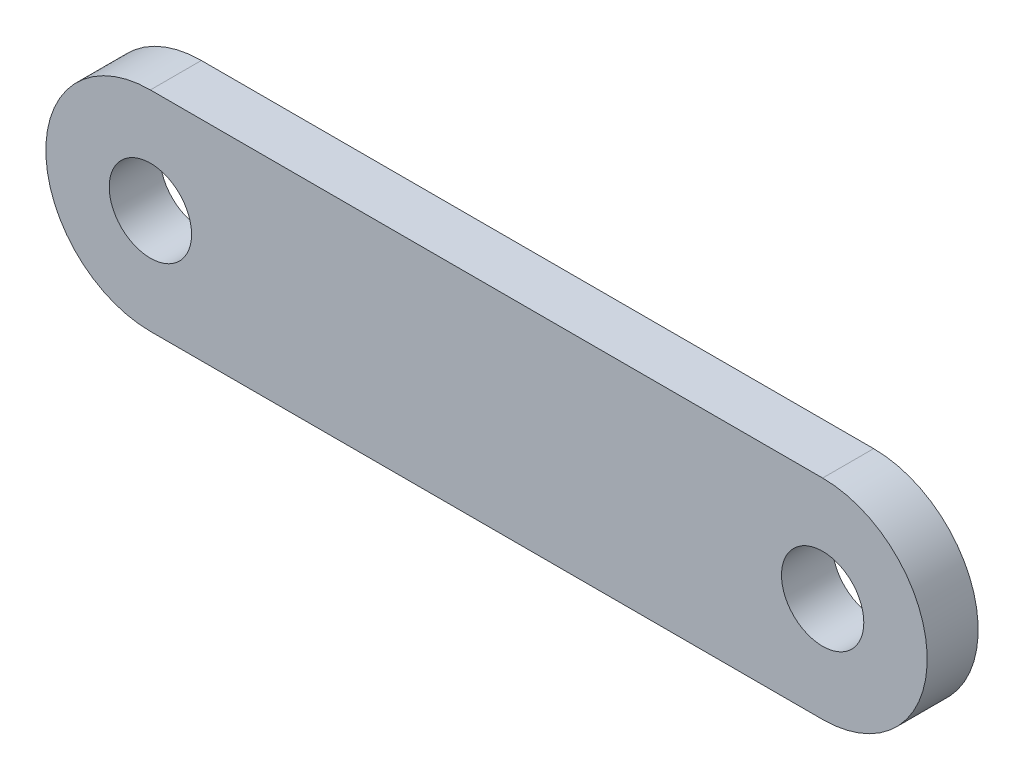
ISO-10303-21;
HEADER;
FILE_DESCRIPTION(('STEP AP214'),'2;1');
FILE_NAME('part.step','',(''),(''),'','','');
FILE_SCHEMA(('AUTOMOTIVE_DESIGN { 1 0 10303 214 1 1 1 1 }'));
ENDSEC;
DATA;
#1=APPLICATION_CONTEXT('core data for automotive mechanical design processes');
#2=APPLICATION_PROTOCOL_DEFINITION('international standard','automotive_design',2000,#1);
#3=PRODUCT_CONTEXT('',#1,'mechanical');
#4=PRODUCT('Part','Part','',(#3));
#5=PRODUCT_RELATED_PRODUCT_CATEGORY('part','',(#4));
#6=PRODUCT_DEFINITION_FORMATION('','',#4);
#7=PRODUCT_DEFINITION_CONTEXT('part definition',#1,'design');
#8=PRODUCT_DEFINITION('design','',#6,#7);
#9=PRODUCT_DEFINITION_SHAPE('','',#8);
#10=(LENGTH_UNIT() NAMED_UNIT(*) SI_UNIT(.MILLI.,.METRE.));
#11=(NAMED_UNIT(*) PLANE_ANGLE_UNIT() SI_UNIT($,.RADIAN.));
#12=(NAMED_UNIT(*) SI_UNIT($,.STERADIAN.) SOLID_ANGLE_UNIT());
#13=UNCERTAINTY_MEASURE_WITH_UNIT(LENGTH_MEASURE(1.E-05),#10,'distance_accuracy_value','');
#14=(GEOMETRIC_REPRESENTATION_CONTEXT(3) GLOBAL_UNCERTAINTY_ASSIGNED_CONTEXT((#13)) GLOBAL_UNIT_ASSIGNED_CONTEXT((#10,
#11,#12)) REPRESENTATION_CONTEXT('',''));
#15=CARTESIAN_POINT('',(0.,0.,0.));
#16=DIRECTION('',(0.,0.,1.));
#17=DIRECTION('',(1.,0.,0.));
#18=AXIS2_PLACEMENT_3D('',#15,#16,#17);
#19=CARTESIAN_POINT('',(25.7175,0.,3.9));
#20=DIRECTION('',(0.,0.,1.));
#21=DIRECTION('',(1.,0.,0.));
#22=AXIS2_PLACEMENT_3D('',#19,#20,#21);
#23=PLANE('',#22);
#24=CARTESIAN_POINT('',(25.7175,0.,3.9));
#25=DIRECTION('',(0.,0.,1.));
#26=DIRECTION('',(1.,0.,0.));
#27=AXIS2_PLACEMENT_3D('',#24,#25,#26);
#28=CIRCLE('',#27,3.15);
#29=CARTESIAN_POINT('',(28.8675,0.,3.9));
#30=VERTEX_POINT('',#29);
#31=EDGE_CURVE('E112',#30,#30,#28,.T.);
#32=ORIENTED_EDGE('',*,*,#31,.F.);
#33=EDGE_LOOP('',(#32));
#34=FACE_BOUND('',#33,.T.);
#35=CARTESIAN_POINT('',(25.7175,0.,3.9));
#36=DIRECTION('',(0.,0.,1.));
#37=DIRECTION('',(1.,0.,0.));
#38=AXIS2_PLACEMENT_3D('',#35,#36,#37);
#39=CIRCLE('',#38,8.);
#40=CARTESIAN_POINT('',(25.7175,-7.99999999999999,3.9));
#41=VERTEX_POINT('',#40);
#42=CARTESIAN_POINT('',(25.7175,8.00000000000001,3.9));
#43=VERTEX_POINT('',#42);
#44=EDGE_CURVE('E92',#41,#43,#39,.T.);
#45=ORIENTED_EDGE('',*,*,#44,.T.);
#46=DIRECTION('',(-1.,0.,0.));
#47=VECTOR('',#46,1.);
#48=CARTESIAN_POINT('',(25.7175,8.00000000000001,3.9));
#49=LINE('',#48,#47);
#50=CARTESIAN_POINT('',(-25.7175,8.,3.9));
#51=VERTEX_POINT('',#50);
#52=EDGE_CURVE('E87',#43,#51,#49,.T.);
#53=ORIENTED_EDGE('',*,*,#52,.T.);
#54=CARTESIAN_POINT('',(-25.7175,0.,3.9));
#55=DIRECTION('',(0.,0.,1.));
#56=DIRECTION('',(1.,0.,0.));
#57=AXIS2_PLACEMENT_3D('',#54,#55,#56);
#58=CIRCLE('',#57,8.);
#59=CARTESIAN_POINT('',(-25.7175,-8.00000000000001,3.9));
#60=VERTEX_POINT('',#59);
#61=EDGE_CURVE('E90',#51,#60,#58,.T.);
#62=ORIENTED_EDGE('',*,*,#61,.T.);
#63=DIRECTION('',(1.,0.,0.));
#64=VECTOR('',#63,1.);
#65=CARTESIAN_POINT('',(25.7175,-7.99999999999999,3.9));
#66=LINE('',#65,#64);
#67=EDGE_CURVE('E57',#60,#41,#66,.T.);
#68=ORIENTED_EDGE('',*,*,#67,.T.);
#69=EDGE_LOOP('',(#45,#53,#62,#68));
#70=FACE_BOUND('',#69,.T.);
#71=CARTESIAN_POINT('',(-25.7175,0.,3.9));
#72=DIRECTION('',(0.,0.,1.));
#73=DIRECTION('',(1.,0.,0.));
#74=AXIS2_PLACEMENT_3D('',#71,#72,#73);
#75=CIRCLE('',#74,3.15);
#76=CARTESIAN_POINT('',(-22.5675,0.,3.9));
#77=VERTEX_POINT('',#76);
#78=EDGE_CURVE('E134',#77,#77,#75,.T.);
#79=ORIENTED_EDGE('',*,*,#78,.F.);
#80=EDGE_LOOP('',(#79));
#81=FACE_BOUND('',#80,.T.);
#82=ADVANCED_FACE('F39',(#34,#70,#81),#23,.T.);
#83=CARTESIAN_POINT('',(25.7175,0.,0.));
#84=DIRECTION('',(0.,0.,1.));
#85=DIRECTION('',(1.,0.,0.));
#86=AXIS2_PLACEMENT_3D('',#83,#84,#85);
#87=PLANE('',#86);
#88=CARTESIAN_POINT('',(25.7175,0.,0.));
#89=DIRECTION('',(0.,0.,1.));
#90=DIRECTION('',(1.,0.,0.));
#91=AXIS2_PLACEMENT_3D('',#88,#89,#90);
#92=CIRCLE('',#91,8.);
#93=CARTESIAN_POINT('',(25.7175,-7.99999999999999,0.));
#94=VERTEX_POINT('',#93);
#95=CARTESIAN_POINT('',(25.7175,8.00000000000001,0.));
#96=VERTEX_POINT('',#95);
#97=EDGE_CURVE('E108',#94,#96,#92,.T.);
#98=ORIENTED_EDGE('',*,*,#97,.F.);
#99=DIRECTION('',(1.,0.,0.));
#100=VECTOR('',#99,1.);
#101=CARTESIAN_POINT('',(25.7175,-7.99999999999999,0.));
#102=LINE('',#101,#100);
#103=CARTESIAN_POINT('',(-25.7175,-8.00000000000001,0.));
#104=VERTEX_POINT('',#103);
#105=EDGE_CURVE('E80',#104,#94,#102,.T.);
#106=ORIENTED_EDGE('',*,*,#105,.F.);
#107=CARTESIAN_POINT('',(-25.7175,0.,0.));
#108=DIRECTION('',(0.,0.,1.));
#109=DIRECTION('',(1.,0.,0.));
#110=AXIS2_PLACEMENT_3D('',#107,#108,#109);
#111=CIRCLE('',#110,8.);
#112=CARTESIAN_POINT('',(-25.7175,8.,0.));
#113=VERTEX_POINT('',#112);
#114=EDGE_CURVE('E74',#113,#104,#111,.T.);
#115=ORIENTED_EDGE('',*,*,#114,.F.);
#116=DIRECTION('',(-1.,0.,0.));
#117=VECTOR('',#116,1.);
#118=CARTESIAN_POINT('',(25.7175,8.00000000000001,0.));
#119=LINE('',#118,#117);
#120=EDGE_CURVE('E97',#96,#113,#119,.T.);
#121=ORIENTED_EDGE('',*,*,#120,.F.);
#122=EDGE_LOOP('',(#98,#106,#115,#121));
#123=FACE_BOUND('',#122,.T.);
#124=CARTESIAN_POINT('',(25.7175,0.,0.));
#125=DIRECTION('',(0.,0.,1.));
#126=DIRECTION('',(1.,0.,0.));
#127=AXIS2_PLACEMENT_3D('',#124,#125,#126);
#128=CIRCLE('',#127,3.15);
#129=CARTESIAN_POINT('',(28.8675,0.,0.));
#130=VERTEX_POINT('',#129);
#131=EDGE_CURVE('E130',#130,#130,#128,.T.);
#132=ORIENTED_EDGE('',*,*,#131,.T.);
#133=EDGE_LOOP('',(#132));
#134=FACE_BOUND('',#133,.T.);
#135=CARTESIAN_POINT('',(-25.7175,0.,0.));
#136=DIRECTION('',(0.,0.,1.));
#137=DIRECTION('',(1.,0.,0.));
#138=AXIS2_PLACEMENT_3D('',#135,#136,#137);
#139=CIRCLE('',#138,3.15);
#140=CARTESIAN_POINT('',(-22.5675,0.,0.));
#141=VERTEX_POINT('',#140);
#142=EDGE_CURVE('E138',#141,#141,#139,.T.);
#143=ORIENTED_EDGE('',*,*,#142,.T.);
#144=EDGE_LOOP('',(#143));
#145=FACE_BOUND('',#144,.T.);
#146=ADVANCED_FACE('F125',(#123,#134,#145),#87,.F.);
#147=CARTESIAN_POINT('',(25.7175,0.,3.9));
#148=DIRECTION('',(0.,0.,-1.));
#149=DIRECTION('',(-1.,0.,0.));
#150=AXIS2_PLACEMENT_3D('',#147,#148,#149);
#151=CYLINDRICAL_SURFACE('',#150,8.);
#152=ORIENTED_EDGE('',*,*,#97,.T.);
#153=DIRECTION('',(0.,0.,-1.));
#154=VECTOR('',#153,1.);
#155=CARTESIAN_POINT('',(25.7175,8.00000000000001,3.9));
#156=LINE('',#155,#154);
#157=EDGE_CURVE('E11',#43,#96,#156,.T.);
#158=ORIENTED_EDGE('',*,*,#157,.F.);
#159=ORIENTED_EDGE('',*,*,#44,.F.);
#160=DIRECTION('',(0.,0.,-1.));
#161=VECTOR('',#160,1.);
#162=CARTESIAN_POINT('',(25.7175,-7.99999999999999,3.9));
#163=LINE('',#162,#161);
#164=EDGE_CURVE('E104',#41,#94,#163,.T.);
#165=ORIENTED_EDGE('',*,*,#164,.T.);
#166=EDGE_LOOP('',(#152,#158,#159,#165));
#167=FACE_BOUND('',#166,.T.);
#168=ADVANCED_FACE('F41',(#167),#151,.T.);
#169=CARTESIAN_POINT('',(25.7175,8.00000000000001,3.9));
#170=DIRECTION('',(0.,-1.,0.));
#171=DIRECTION('',(1.,0.,0.));
#172=AXIS2_PLACEMENT_3D('',#169,#170,#171);
#173=PLANE('',#172);
#174=ORIENTED_EDGE('',*,*,#120,.T.);
#175=DIRECTION('',(0.,0.,-1.));
#176=VECTOR('',#175,1.);
#177=CARTESIAN_POINT('',(-25.7175,8.,3.9));
#178=LINE('',#177,#176);
#179=EDGE_CURVE('E49',#51,#113,#178,.T.);
#180=ORIENTED_EDGE('',*,*,#179,.F.);
#181=ORIENTED_EDGE('',*,*,#52,.F.);
#182=ORIENTED_EDGE('',*,*,#157,.T.);
#183=EDGE_LOOP('',(#174,#180,#181,#182));
#184=FACE_BOUND('',#183,.T.);
#185=ADVANCED_FACE('F96',(#184),#173,.F.);
#186=CARTESIAN_POINT('',(-25.7175,0.,3.9));
#187=DIRECTION('',(0.,0.,-1.));
#188=DIRECTION('',(-1.,0.,0.));
#189=AXIS2_PLACEMENT_3D('',#186,#187,#188);
#190=CYLINDRICAL_SURFACE('',#189,8.);
#191=ORIENTED_EDGE('',*,*,#114,.T.);
#192=DIRECTION('',(0.,0.,-1.));
#193=VECTOR('',#192,1.);
#194=CARTESIAN_POINT('',(-25.7175,-8.00000000000001,3.9));
#195=LINE('',#194,#193);
#196=EDGE_CURVE('E99',#60,#104,#195,.T.);
#197=ORIENTED_EDGE('',*,*,#196,.F.);
#198=ORIENTED_EDGE('',*,*,#61,.F.);
#199=ORIENTED_EDGE('',*,*,#179,.T.);
#200=EDGE_LOOP('',(#191,#197,#198,#199));
#201=FACE_BOUND('',#200,.T.);
#202=ADVANCED_FACE('F100',(#201),#190,.T.);
#203=CARTESIAN_POINT('',(25.7175,-7.99999999999999,3.9));
#204=DIRECTION('',(0.,1.,0.));
#205=DIRECTION('',(-1.,0.,0.));
#206=AXIS2_PLACEMENT_3D('',#203,#204,#205);
#207=PLANE('',#206);
#208=ORIENTED_EDGE('',*,*,#105,.T.);
#209=ORIENTED_EDGE('',*,*,#164,.F.);
#210=ORIENTED_EDGE('',*,*,#67,.F.);
#211=ORIENTED_EDGE('',*,*,#196,.T.);
#212=EDGE_LOOP('',(#208,#209,#210,#211));
#213=FACE_BOUND('',#212,.T.);
#214=ADVANCED_FACE('F122',(#213),#207,.F.);
#215=CARTESIAN_POINT('',(25.7175,0.,3.9));
#216=DIRECTION('',(0.,0.,-1.));
#217=DIRECTION('',(-1.,0.,0.));
#218=AXIS2_PLACEMENT_3D('',#215,#216,#217);
#219=CYLINDRICAL_SURFACE('',#218,3.15);
#220=ORIENTED_EDGE('',*,*,#31,.T.);
#221=EDGE_LOOP('',(#220));
#222=FACE_BOUND('',#221,.T.);
#223=ORIENTED_EDGE('',*,*,#131,.F.);
#224=EDGE_LOOP('',(#223));
#225=FACE_BOUND('',#224,.T.);
#226=ADVANCED_FACE('F157',(#222,#225),#219,.F.);
#227=CARTESIAN_POINT('',(-25.7175,0.,3.9));
#228=DIRECTION('',(0.,0.,-1.));
#229=DIRECTION('',(-1.,0.,0.));
#230=AXIS2_PLACEMENT_3D('',#227,#228,#229);
#231=CYLINDRICAL_SURFACE('',#230,3.15);
#232=ORIENTED_EDGE('',*,*,#78,.T.);
#233=EDGE_LOOP('',(#232));
#234=FACE_BOUND('',#233,.T.);
#235=ORIENTED_EDGE('',*,*,#142,.F.);
#236=EDGE_LOOP('',(#235));
#237=FACE_BOUND('',#236,.T.);
#238=ADVANCED_FACE('F146',(#234,#237),#231,.F.);
#239=CLOSED_SHELL('',(#82,#146,#168,#185,#202,#214,#226,#238));
#240=MANIFOLD_SOLID_BREP('B2',#239);
#241=ADVANCED_BREP_SHAPE_REPRESENTATION('',(#18,#240),#14);
#242=SHAPE_DEFINITION_REPRESENTATION(#9,#241);
ENDSEC;
END-ISO-10303-21;
